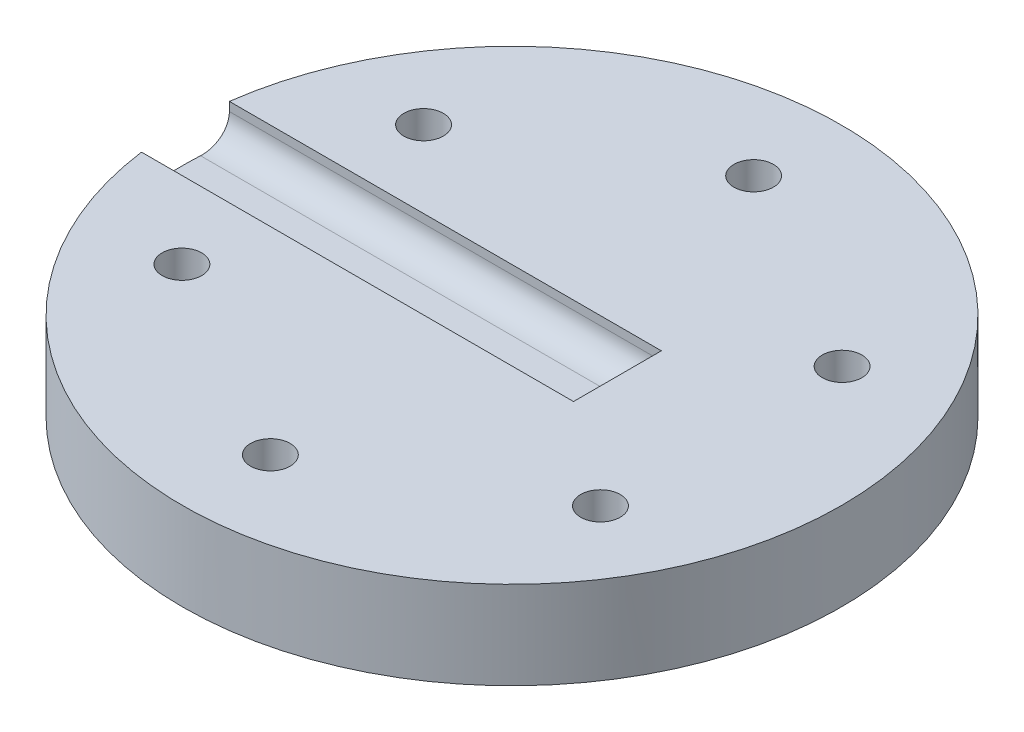
ISO-10303-21;
HEADER;
FILE_DESCRIPTION(('STEP AP214'),'2;1');
FILE_NAME('part.step','',(''),(''),'','','');
FILE_SCHEMA(('AUTOMOTIVE_DESIGN { 1 0 10303 214 1 1 1 1 }'));
ENDSEC;
DATA;
#1=APPLICATION_CONTEXT('core data for automotive mechanical design processes');
#2=APPLICATION_PROTOCOL_DEFINITION('international standard','automotive_design',2000,#1);
#3=PRODUCT_CONTEXT('',#1,'mechanical');
#4=PRODUCT('Part','Part','',(#3));
#5=PRODUCT_RELATED_PRODUCT_CATEGORY('part','',(#4));
#6=PRODUCT_DEFINITION_FORMATION('','',#4);
#7=PRODUCT_DEFINITION_CONTEXT('part definition',#1,'design');
#8=PRODUCT_DEFINITION('design','',#6,#7);
#9=PRODUCT_DEFINITION_SHAPE('','',#8);
#10=(LENGTH_UNIT() NAMED_UNIT(*) SI_UNIT(.MILLI.,.METRE.));
#11=(NAMED_UNIT(*) PLANE_ANGLE_UNIT() SI_UNIT($,.RADIAN.));
#12=(NAMED_UNIT(*) SI_UNIT($,.STERADIAN.) SOLID_ANGLE_UNIT());
#13=UNCERTAINTY_MEASURE_WITH_UNIT(LENGTH_MEASURE(1.E-05),#10,'distance_accuracy_value','');
#14=(GEOMETRIC_REPRESENTATION_CONTEXT(3) GLOBAL_UNCERTAINTY_ASSIGNED_CONTEXT((#13)) GLOBAL_UNIT_ASSIGNED_CONTEXT((#10,
#11,#12)) REPRESENTATION_CONTEXT('',''));
#15=CARTESIAN_POINT('',(0.,0.,0.));
#16=DIRECTION('',(0.,0.,1.));
#17=DIRECTION('',(1.,0.,0.));
#18=AXIS2_PLACEMENT_3D('',#15,#16,#17);
#19=CARTESIAN_POINT('',(0.,10.,0.));
#20=DIRECTION('',(0.,1.,0.));
#21=DIRECTION('',(0.,0.,1.));
#22=AXIS2_PLACEMENT_3D('',#19,#20,#21);
#23=PLANE('',#22);
#24=CARTESIAN_POINT('',(-23.8156986040715,10.,-13.749999999999));
#25=DIRECTION('',(0.,1.,0.));
#26=DIRECTION('',(0.,0.,1.));
#27=AXIS2_PLACEMENT_3D('',#24,#25,#26);
#28=CIRCLE('',#27,2.25);
#29=CARTESIAN_POINT('',(-23.8156986040715,10.,-11.499999999999));
#30=VERTEX_POINT('',#29);
#31=EDGE_CURVE('E120',#30,#30,#28,.T.);
#32=ORIENTED_EDGE('',*,*,#31,.F.);
#33=EDGE_LOOP('',(#32));
#34=FACE_BOUND('',#33,.T.);
#35=CARTESIAN_POINT('',(2.33805547061302E-12,10.,27.5));
#36=DIRECTION('',(0.,1.,0.));
#37=DIRECTION('',(0.,0.,1.));
#38=AXIS2_PLACEMENT_3D('',#35,#36,#37);
#39=CIRCLE('',#38,2.25);
#40=CARTESIAN_POINT('',(2.33805547061302E-12,10.,29.75));
#41=VERTEX_POINT('',#40);
#42=EDGE_CURVE('E132',#41,#41,#39,.T.);
#43=ORIENTED_EDGE('',*,*,#42,.F.);
#44=EDGE_LOOP('',(#43));
#45=FACE_BOUND('',#44,.T.);
#46=CARTESIAN_POINT('',(23.8156986040726,10.,-13.750000000001));
#47=DIRECTION('',(0.,1.,0.));
#48=DIRECTION('',(0.,0.,1.));
#49=AXIS2_PLACEMENT_3D('',#46,#47,#48);
#50=CIRCLE('',#49,2.25);
#51=CARTESIAN_POINT('',(23.8156986040726,10.,-11.500000000001));
#52=VERTEX_POINT('',#51);
#53=EDGE_CURVE('E144',#52,#52,#50,.T.);
#54=ORIENTED_EDGE('',*,*,#53,.F.);
#55=EDGE_LOOP('',(#54));
#56=FACE_BOUND('',#55,.T.);
#57=CARTESIAN_POINT('',(0.,10.,-27.5));
#58=DIRECTION('',(0.,1.,0.));
#59=DIRECTION('',(0.,0.,1.));
#60=AXIS2_PLACEMENT_3D('',#57,#58,#59);
#61=CIRCLE('',#60,2.25);
#62=CARTESIAN_POINT('',(0.,10.,-25.25));
#63=VERTEX_POINT('',#62);
#64=EDGE_CURVE('E150',#63,#63,#61,.T.);
#65=ORIENTED_EDGE('',*,*,#64,.F.);
#66=EDGE_LOOP('',(#65));
#67=FACE_BOUND('',#66,.T.);
#68=CARTESIAN_POINT('',(23.8156986040738,10.,13.749999999999));
#69=DIRECTION('',(0.,1.,0.));
#70=DIRECTION('',(0.,0.,1.));
#71=AXIS2_PLACEMENT_3D('',#68,#69,#70);
#72=CIRCLE('',#71,2.25);
#73=CARTESIAN_POINT('',(23.8156986040738,10.,15.999999999999));
#74=VERTEX_POINT('',#73);
#75=EDGE_CURVE('E138',#74,#74,#72,.T.);
#76=ORIENTED_EDGE('',*,*,#75,.F.);
#77=EDGE_LOOP('',(#76));
#78=FACE_BOUND('',#77,.T.);
#79=CARTESIAN_POINT('',(-23.8156986040703,10.,13.750000000001));
#80=DIRECTION('',(0.,1.,0.));
#81=DIRECTION('',(0.,0.,1.));
#82=AXIS2_PLACEMENT_3D('',#79,#80,#81);
#83=CIRCLE('',#82,2.25);
#84=CARTESIAN_POINT('',(-23.8156986040703,10.,16.000000000001));
#85=VERTEX_POINT('',#84);
#86=EDGE_CURVE('E126',#85,#85,#83,.T.);
#87=ORIENTED_EDGE('',*,*,#86,.F.);
#88=EDGE_LOOP('',(#87));
#89=FACE_BOUND('',#88,.T.);
#90=DIRECTION('',(0.,0.,1.));
#91=VECTOR('',#90,1.);
#92=CARTESIAN_POINT('',(12.,10.,0.));
#93=LINE('',#92,#91);
#94=CARTESIAN_POINT('',(12.,10.,-4.99999999999996));
#95=VERTEX_POINT('',#94);
#96=CARTESIAN_POINT('',(12.,10.,4.99999999999996));
#97=VERTEX_POINT('',#96);
#98=EDGE_CURVE('E101',#95,#97,#93,.T.);
#99=ORIENTED_EDGE('',*,*,#98,.T.);
#100=DIRECTION('',(-1.,0.,0.));
#101=VECTOR('',#100,1.);
#102=CARTESIAN_POINT('',(0.,10.,5.));
#103=LINE('',#102,#101);
#104=CARTESIAN_POINT('',(-37.1651718682963,10.,4.99999999999987));
#105=VERTEX_POINT('',#104);
#106=EDGE_CURVE('E110',#97,#105,#103,.T.);
#107=ORIENTED_EDGE('',*,*,#106,.T.);
#108=CARTESIAN_POINT('',(0.,10.,0.));
#109=DIRECTION('',(0.,1.,0.));
#110=DIRECTION('',(0.,0.,1.));
#111=AXIS2_PLACEMENT_3D('',#108,#109,#110);
#112=CIRCLE('',#111,37.5);
#113=CARTESIAN_POINT('',(-37.1651718682962,10.,-5.00000000000013));
#114=VERTEX_POINT('',#113);
#115=EDGE_CURVE('E109',#105,#114,#112,.T.);
#116=ORIENTED_EDGE('',*,*,#115,.T.);
#117=DIRECTION('',(-1.,0.,0.));
#118=VECTOR('',#117,1.);
#119=CARTESIAN_POINT('',(0.,10.,-5.));
#120=LINE('',#119,#118);
#121=EDGE_CURVE('E93',#95,#114,#120,.T.);
#122=ORIENTED_EDGE('',*,*,#121,.F.);
#123=EDGE_LOOP('',(#99,#107,#116,#122));
#124=FACE_BOUND('',#123,.T.);
#125=ADVANCED_FACE('F33',(#34,#45,#56,#67,#78,#89,#124),#23,.T.);
#126=CARTESIAN_POINT('',(0.,10.,0.));
#127=DIRECTION('',(0.,-1.,0.));
#128=DIRECTION('',(0.,0.,-1.));
#129=AXIS2_PLACEMENT_3D('',#126,#127,#128);
#130=CYLINDRICAL_SURFACE('',#129,37.5);
#131=CARTESIAN_POINT('',(0.,0.,0.));
#132=DIRECTION('',(0.,1.,0.));
#133=DIRECTION('',(0.,0.,1.));
#134=AXIS2_PLACEMENT_3D('',#131,#132,#133);
#135=CIRCLE('',#134,37.5);
#136=CARTESIAN_POINT('',(0.,0.,37.5));
#137=VERTEX_POINT('',#136);
#138=EDGE_CURVE('E153',#137,#137,#135,.T.);
#139=ORIENTED_EDGE('',*,*,#138,.T.);
#140=EDGE_LOOP('',(#139));
#141=FACE_BOUND('',#140,.T.);
#142=DIRECTION('',(0.,1.,0.));
#143=VECTOR('',#142,1.);
#144=CARTESIAN_POINT('',(-37.1651718682963,6.,4.99999999999987));
#145=LINE('',#144,#143);
#146=CARTESIAN_POINT('',(-37.1651718682963,9.,4.99999999999987));
#147=VERTEX_POINT('',#146);
#148=EDGE_CURVE('E117',#147,#105,#145,.T.);
#149=ORIENTED_EDGE('',*,*,#148,.F.);
#150=CARTESIAN_POINT('',(-37.1651718682963,9.,4.99999999999987));
#151=CARTESIAN_POINT('',(-37.1651685932494,8.91607473093556,5.00000850912993));
#152=CARTESIAN_POINT('',(-37.1656455989452,8.83215369455785,4.99647833367304));
#153=CARTESIAN_POINT('',(-37.1675358092273,8.66491826832527,4.98240646129069));
#154=CARTESIAN_POINT('',(-37.1689489434135,8.58160383332813,4.97186529161641));
#155=CARTESIAN_POINT('',(-37.1726850296843,8.41625662107855,4.94385244499646));
#156=CARTESIAN_POINT('',(-37.1750069942758,8.33422255290289,4.92638828998331));
#157=CARTESIAN_POINT('',(-37.1805105754043,8.17195103866243,4.88467724581381));
#158=CARTESIAN_POINT('',(-37.1836921862674,8.09171358074312,4.86043040142569));
#159=CARTESIAN_POINT('',(-37.1944408568588,7.8544882674871,4.77773055653877));
#160=CARTESIAN_POINT('',(-37.2032138737354,7.70089770069336,4.70930293695221));
#161=CARTESIAN_POINT('',(-37.2232832126167,7.40749281606239,4.54793917186818));
#162=CARTESIAN_POINT('',(-37.2345793683077,7.26767759109256,4.45500464168136));
#163=CARTESIAN_POINT('',(-37.2589116242929,7.00487012995653,4.24670781825409));
#164=CARTESIAN_POINT('',(-37.2719562576053,6.88196680121549,4.13123418046848));
#165=CARTESIAN_POINT('',(-37.2988015372646,6.6572171945591,3.88138598341652));
#166=CARTESIAN_POINT('',(-37.3126023471844,6.55537549553449,3.74700732476296));
#167=CARTESIAN_POINT('',(-37.3401120237986,6.3749911604644,3.46216999762798));
#168=CARTESIAN_POINT('',(-37.3538196771137,6.29660721864267,3.3116107736077));
#169=CARTESIAN_POINT('',(-37.3801828948026,6.16631519135388,2.99940021790014));
#170=CARTESIAN_POINT('',(-37.3928390809635,6.11439136402112,2.83775554635983));
#171=CARTESIAN_POINT('',(-37.4124983738007,6.05106027067528,2.56265705060473));
#172=CARTESIAN_POINT('',(-37.4199863799291,6.03193164985782,2.4509543538735));
#173=CARTESIAN_POINT('',(-37.4340334639008,6.0064015837983,2.22619359073371));
#174=CARTESIAN_POINT('',(-37.4405937269621,5.9999837612315,2.11313745748277));
#175=CARTESIAN_POINT('',(-37.4466286867056,6.,1.99999999999987));
#176=B_SPLINE_CURVE_WITH_KNOTS('',3,(#150,#151,#152,#153,#154,#155,#156,#157,#158,#159,#160,
#161,#162,#163,#164,#165,#166,#167,#168,#169,#170,#171,#172,#173,#174,#175),.UNSPECIFIED.,.F.,
.F.,(4,2,2,2,2,2,2,2,2,2,2,2,4),(0.,0.251692700658803,0.503366475289662,0.754767548613931,
1.00616696263818,1.50869595507598,2.01119183286945,2.51623594149171,3.02138973376223,
3.52988746532684,4.03808232308492,4.378130837416,4.71774092787654),.UNSPECIFIED.);
#177=CARTESIAN_POINT('',(-37.4466286867056,6.,1.99999999999987));
#178=VERTEX_POINT('',#177);
#179=EDGE_CURVE('E11',#147,#178,#176,.T.);
#180=ORIENTED_EDGE('',*,*,#179,.T.);
#181=CARTESIAN_POINT('',(0.,6.,0.));
#182=DIRECTION('',(0.,1.,0.));
#183=DIRECTION('',(0.,0.,1.));
#184=AXIS2_PLACEMENT_3D('',#181,#182,#183);
#185=CIRCLE('',#184,37.5);
#186=CARTESIAN_POINT('',(-37.4466286867056,6.,-2.00000000000013));
#187=VERTEX_POINT('',#186);
#188=EDGE_CURVE('E98',#187,#178,#185,.T.);
#189=ORIENTED_EDGE('',*,*,#188,.F.);
#190=CARTESIAN_POINT('',(-37.4466286867056,6.,-2.00000000000013));
#191=CARTESIAN_POINT('',(-37.442115393869,5.99999185556205,-2.08455601031386));
#192=CARTESIAN_POINT('',(-37.4373104530759,6.00357480316312,-2.16909175411238));
#193=CARTESIAN_POINT('',(-37.4271699634153,6.01785162064364,-2.33752249353557));
#194=CARTESIAN_POINT('',(-37.4218344541868,6.0285449596416,-2.42141753652377));
#195=CARTESIAN_POINT('',(-37.4106898894076,6.05695840872291,-2.58790382027702));
#196=CARTESIAN_POINT('',(-37.4048812683641,6.07467212781287,-2.67049617603146));
#197=CARTESIAN_POINT('',(-37.3928607707032,6.11697580130757,-2.83384627853584));
#198=CARTESIAN_POINT('',(-37.38664889606,6.14156572205405,-2.91460403426386));
#199=CARTESIAN_POINT('',(-37.3675242861865,6.22543430714798,-3.15333187203809));
#200=CARTESIAN_POINT('',(-37.3541164861043,6.29482717691523,-3.3078460844972));
#201=CARTESIAN_POINT('',(-37.3268156238785,6.45850047242245,-3.60289767557243));
#202=CARTESIAN_POINT('',(-37.3129226100249,6.5527784276038,-3.74343643974693));
#203=CARTESIAN_POINT('',(-37.285527433741,6.76392513867184,-4.00712813795826));
#204=CARTESIAN_POINT('',(-37.272026519585,6.8808585198335,-4.13022954973076));
#205=CARTESIAN_POINT('',(-37.2464263718208,7.13389913639611,-4.35506235412042));
#206=CARTESIAN_POINT('',(-37.2343273880348,7.27000977961427,-4.45678994056759));
#207=CARTESIAN_POINT('',(-37.2124653695551,7.55735594322181,-4.63579209345191));
#208=CARTESIAN_POINT('',(-37.2026991420278,7.7085703841388,-4.71310013012715));
#209=CARTESIAN_POINT('',(-37.1862553206564,8.02197020400218,-4.84113735417302));
#210=CARTESIAN_POINT('',(-37.1795756321588,8.18414805679171,-4.89188456993313));
#211=CARTESIAN_POINT('',(-37.171562377065,8.45615411997132,-4.95232456520221));
#212=CARTESIAN_POINT('',(-37.1691734992545,8.5642051706132,-4.97018998012791));
#213=CARTESIAN_POINT('',(-37.1659755418647,8.78148800360132,-4.99402686353313));
#214=CARTESIAN_POINT('',(-37.1651643604894,8.89071801987916,-5.00001415617528));
#215=CARTESIAN_POINT('',(-37.1651718682962,9.,-5.00000000000013));
#216=B_SPLINE_CURVE_WITH_KNOTS('',3,(#190,#191,#192,#193,#194,#195,#196,#197,#198,#199,#200,
#201,#202,#203,#204,#205,#206,#207,#208,#209,#210,#211,#212,#213,#214,#215),.UNSPECIFIED.,.F.,
.F.,(4,2,2,2,2,2,2,2,2,2,2,2,4),(0.,0.253944686852566,0.507870415620479,0.761565512474325,
1.01525936754025,1.52237729016386,2.02944488570951,2.53798078818341,3.04660717219958,
3.55453336036125,4.06211434061417,4.39012991539726,4.71770821006359),.UNSPECIFIED.);
#217=CARTESIAN_POINT('',(-37.1651718682962,9.,-5.00000000000013));
#218=VERTEX_POINT('',#217);
#219=EDGE_CURVE('E43',#187,#218,#216,.T.);
#220=ORIENTED_EDGE('',*,*,#219,.T.);
#221=DIRECTION('',(0.,1.,0.));
#222=VECTOR('',#221,1.);
#223=CARTESIAN_POINT('',(-37.1651718682962,6.,-5.00000000000013));
#224=LINE('',#223,#222);
#225=EDGE_CURVE('E97',#218,#114,#224,.T.);
#226=ORIENTED_EDGE('',*,*,#225,.T.);
#227=ORIENTED_EDGE('',*,*,#115,.F.);
#228=EDGE_LOOP('',(#149,#180,#189,#220,#226,#227));
#229=FACE_BOUND('',#228,.T.);
#230=ADVANCED_FACE('F177',(#141,#229),#130,.T.);
#231=CARTESIAN_POINT('',(0.,0.,0.));
#232=DIRECTION('',(0.,1.,0.));
#233=DIRECTION('',(0.,0.,1.));
#234=AXIS2_PLACEMENT_3D('',#231,#232,#233);
#235=PLANE('',#234);
#236=CARTESIAN_POINT('',(-23.8156986040703,0.,13.750000000001));
#237=DIRECTION('',(0.,1.,0.));
#238=DIRECTION('',(0.,0.,1.));
#239=AXIS2_PLACEMENT_3D('',#236,#237,#238);
#240=CIRCLE('',#239,2.25);
#241=CARTESIAN_POINT('',(-23.8156986040703,0.,16.000000000001));
#242=VERTEX_POINT('',#241);
#243=EDGE_CURVE('E123',#242,#242,#240,.T.);
#244=ORIENTED_EDGE('',*,*,#243,.T.);
#245=EDGE_LOOP('',(#244));
#246=FACE_BOUND('',#245,.T.);
#247=CARTESIAN_POINT('',(23.8156986040738,0.,13.749999999999));
#248=DIRECTION('',(0.,1.,0.));
#249=DIRECTION('',(0.,0.,1.));
#250=AXIS2_PLACEMENT_3D('',#247,#248,#249);
#251=CIRCLE('',#250,2.25);
#252=CARTESIAN_POINT('',(23.8156986040738,0.,15.999999999999));
#253=VERTEX_POINT('',#252);
#254=EDGE_CURVE('E135',#253,#253,#251,.T.);
#255=ORIENTED_EDGE('',*,*,#254,.T.);
#256=EDGE_LOOP('',(#255));
#257=FACE_BOUND('',#256,.T.);
#258=CARTESIAN_POINT('',(0.,0.,-27.5));
#259=DIRECTION('',(0.,1.,0.));
#260=DIRECTION('',(0.,0.,1.));
#261=AXIS2_PLACEMENT_3D('',#258,#259,#260);
#262=CIRCLE('',#261,2.25);
#263=CARTESIAN_POINT('',(0.,0.,-25.25));
#264=VERTEX_POINT('',#263);
#265=EDGE_CURVE('E147',#264,#264,#262,.T.);
#266=ORIENTED_EDGE('',*,*,#265,.T.);
#267=EDGE_LOOP('',(#266));
#268=FACE_BOUND('',#267,.T.);
#269=ORIENTED_EDGE('',*,*,#138,.F.);
#270=EDGE_LOOP('',(#269));
#271=FACE_BOUND('',#270,.T.);
#272=CARTESIAN_POINT('',(23.8156986040726,0.,-13.750000000001));
#273=DIRECTION('',(0.,1.,0.));
#274=DIRECTION('',(0.,0.,1.));
#275=AXIS2_PLACEMENT_3D('',#272,#273,#274);
#276=CIRCLE('',#275,2.25);
#277=CARTESIAN_POINT('',(23.8156986040726,0.,-11.500000000001));
#278=VERTEX_POINT('',#277);
#279=EDGE_CURVE('E141',#278,#278,#276,.T.);
#280=ORIENTED_EDGE('',*,*,#279,.T.);
#281=EDGE_LOOP('',(#280));
#282=FACE_BOUND('',#281,.T.);
#283=CARTESIAN_POINT('',(2.33805547061302E-12,0.,27.5));
#284=DIRECTION('',(0.,1.,0.));
#285=DIRECTION('',(0.,0.,1.));
#286=AXIS2_PLACEMENT_3D('',#283,#284,#285);
#287=CIRCLE('',#286,2.25);
#288=CARTESIAN_POINT('',(2.33805547061302E-12,0.,29.75));
#289=VERTEX_POINT('',#288);
#290=EDGE_CURVE('E129',#289,#289,#287,.T.);
#291=ORIENTED_EDGE('',*,*,#290,.T.);
#292=EDGE_LOOP('',(#291));
#293=FACE_BOUND('',#292,.T.);
#294=CARTESIAN_POINT('',(-23.8156986040715,0.,-13.749999999999));
#295=DIRECTION('',(0.,1.,0.));
#296=DIRECTION('',(0.,0.,1.));
#297=AXIS2_PLACEMENT_3D('',#294,#295,#296);
#298=CIRCLE('',#297,2.25);
#299=CARTESIAN_POINT('',(-23.8156986040715,0.,-11.499999999999));
#300=VERTEX_POINT('',#299);
#301=EDGE_CURVE('E116',#300,#300,#298,.T.);
#302=ORIENTED_EDGE('',*,*,#301,.T.);
#303=EDGE_LOOP('',(#302));
#304=FACE_BOUND('',#303,.T.);
#305=ADVANCED_FACE('F199',(#246,#257,#268,#271,#282,#293,#304),#235,.F.);
#306=CARTESIAN_POINT('',(0.,10.,-27.5));
#307=DIRECTION('',(0.,-1.,0.));
#308=DIRECTION('',(0.,0.,-1.));
#309=AXIS2_PLACEMENT_3D('',#306,#307,#308);
#310=CYLINDRICAL_SURFACE('',#309,2.25);
#311=ORIENTED_EDGE('',*,*,#64,.T.);
#312=EDGE_LOOP('',(#311));
#313=FACE_BOUND('',#312,.T.);
#314=ORIENTED_EDGE('',*,*,#265,.F.);
#315=EDGE_LOOP('',(#314));
#316=FACE_BOUND('',#315,.T.);
#317=ADVANCED_FACE('F204',(#313,#316),#310,.F.);
#318=CARTESIAN_POINT('',(23.8156986040726,10.,-13.750000000001));
#319=DIRECTION('',(0.,-1.,0.));
#320=DIRECTION('',(0.,0.,-1.));
#321=AXIS2_PLACEMENT_3D('',#318,#319,#320);
#322=CYLINDRICAL_SURFACE('',#321,2.25);
#323=ORIENTED_EDGE('',*,*,#53,.T.);
#324=EDGE_LOOP('',(#323));
#325=FACE_BOUND('',#324,.T.);
#326=ORIENTED_EDGE('',*,*,#279,.F.);
#327=EDGE_LOOP('',(#326));
#328=FACE_BOUND('',#327,.T.);
#329=ADVANCED_FACE('F211',(#325,#328),#322,.F.);
#330=CARTESIAN_POINT('',(23.8156986040738,10.,13.749999999999));
#331=DIRECTION('',(0.,-1.,0.));
#332=DIRECTION('',(0.,0.,-1.));
#333=AXIS2_PLACEMENT_3D('',#330,#331,#332);
#334=CYLINDRICAL_SURFACE('',#333,2.25);
#335=ORIENTED_EDGE('',*,*,#75,.T.);
#336=EDGE_LOOP('',(#335));
#337=FACE_BOUND('',#336,.T.);
#338=ORIENTED_EDGE('',*,*,#254,.F.);
#339=EDGE_LOOP('',(#338));
#340=FACE_BOUND('',#339,.T.);
#341=ADVANCED_FACE('F245',(#337,#340),#334,.F.);
#342=CARTESIAN_POINT('',(2.33805547061302E-12,10.,27.5));
#343=DIRECTION('',(0.,-1.,0.));
#344=DIRECTION('',(0.,0.,-1.));
#345=AXIS2_PLACEMENT_3D('',#342,#343,#344);
#346=CYLINDRICAL_SURFACE('',#345,2.25);
#347=ORIENTED_EDGE('',*,*,#42,.T.);
#348=EDGE_LOOP('',(#347));
#349=FACE_BOUND('',#348,.T.);
#350=ORIENTED_EDGE('',*,*,#290,.F.);
#351=EDGE_LOOP('',(#350));
#352=FACE_BOUND('',#351,.T.);
#353=ADVANCED_FACE('F238',(#349,#352),#346,.F.);
#354=CARTESIAN_POINT('',(-23.8156986040703,10.,13.750000000001));
#355=DIRECTION('',(0.,-1.,0.));
#356=DIRECTION('',(0.,0.,-1.));
#357=AXIS2_PLACEMENT_3D('',#354,#355,#356);
#358=CYLINDRICAL_SURFACE('',#357,2.25);
#359=ORIENTED_EDGE('',*,*,#86,.T.);
#360=EDGE_LOOP('',(#359));
#361=FACE_BOUND('',#360,.T.);
#362=ORIENTED_EDGE('',*,*,#243,.F.);
#363=EDGE_LOOP('',(#362));
#364=FACE_BOUND('',#363,.T.);
#365=ADVANCED_FACE('F229',(#361,#364),#358,.F.);
#366=CARTESIAN_POINT('',(-23.8156986040715,10.,-13.749999999999));
#367=DIRECTION('',(0.,-1.,0.));
#368=DIRECTION('',(0.,0.,-1.));
#369=AXIS2_PLACEMENT_3D('',#366,#367,#368);
#370=CYLINDRICAL_SURFACE('',#369,2.25);
#371=ORIENTED_EDGE('',*,*,#31,.T.);
#372=EDGE_LOOP('',(#371));
#373=FACE_BOUND('',#372,.T.);
#374=ORIENTED_EDGE('',*,*,#301,.F.);
#375=EDGE_LOOP('',(#374));
#376=FACE_BOUND('',#375,.T.);
#377=ADVANCED_FACE('F227',(#373,#376),#370,.F.);
#378=CARTESIAN_POINT('',(12.,6.,0.));
#379=DIRECTION('',(-1.,0.,0.));
#380=DIRECTION('',(0.,0.,1.));
#381=AXIS2_PLACEMENT_3D('',#378,#379,#380);
#382=PLANE('',#381);
#383=DIRECTION('',(0.,1.,0.));
#384=VECTOR('',#383,1.);
#385=CARTESIAN_POINT('',(12.,6.,-4.99999999999996));
#386=LINE('',#385,#384);
#387=CARTESIAN_POINT('',(12.,9.,-4.99999999999996));
#388=VERTEX_POINT('',#387);
#389=EDGE_CURVE('E88',#388,#95,#386,.T.);
#390=ORIENTED_EDGE('',*,*,#389,.F.);
#391=DIRECTION('',(0.,0.,1.));
#392=VECTOR('',#391,1.);
#393=CARTESIAN_POINT('',(12.,9.,4.99999999999996));
#394=LINE('',#393,#392);
#395=CARTESIAN_POINT('',(12.,9.,4.99999999999996));
#396=VERTEX_POINT('',#395);
#397=EDGE_CURVE('E59',#388,#396,#394,.T.);
#398=ORIENTED_EDGE('',*,*,#397,.T.);
#399=DIRECTION('',(0.,1.,0.));
#400=VECTOR('',#399,1.);
#401=CARTESIAN_POINT('',(12.,6.,4.99999999999996));
#402=LINE('',#401,#400);
#403=EDGE_CURVE('E103',#396,#97,#402,.T.);
#404=ORIENTED_EDGE('',*,*,#403,.T.);
#405=ORIENTED_EDGE('',*,*,#98,.F.);
#406=EDGE_LOOP('',(#390,#398,#404,#405));
#407=FACE_BOUND('',#406,.T.);
#408=ADVANCED_FACE('F102',(#407),#382,.T.);
#409=CARTESIAN_POINT('',(0.,6.,5.));
#410=DIRECTION('',(0.,0.,-1.));
#411=DIRECTION('',(-1.,0.,0.));
#412=AXIS2_PLACEMENT_3D('',#409,#410,#411);
#413=PLANE('',#412);
#414=ORIENTED_EDGE('',*,*,#403,.F.);
#415=DIRECTION('',(-1.,0.,0.));
#416=VECTOR('',#415,1.);
#417=CARTESIAN_POINT('',(-37.1651718682963,9.,4.99999999999987));
#418=LINE('',#417,#416);
#419=EDGE_CURVE('E51',#396,#147,#418,.T.);
#420=ORIENTED_EDGE('',*,*,#419,.T.);
#421=ORIENTED_EDGE('',*,*,#148,.T.);
#422=ORIENTED_EDGE('',*,*,#106,.F.);
#423=EDGE_LOOP('',(#414,#420,#421,#422));
#424=FACE_BOUND('',#423,.T.);
#425=ADVANCED_FACE('F236',(#424),#413,.T.);
#426=CARTESIAN_POINT('',(0.,6.,-5.));
#427=DIRECTION('',(0.,0.,-1.));
#428=DIRECTION('',(-1.,0.,0.));
#429=AXIS2_PLACEMENT_3D('',#426,#427,#428);
#430=PLANE('',#429);
#431=ORIENTED_EDGE('',*,*,#225,.F.);
#432=DIRECTION('',(-1.,0.,0.));
#433=VECTOR('',#432,1.);
#434=CARTESIAN_POINT('',(0.,9.,-5.));
#435=LINE('',#434,#433);
#436=EDGE_CURVE('E96',#218,#388,#435,.F.);
#437=ORIENTED_EDGE('',*,*,#436,.T.);
#438=ORIENTED_EDGE('',*,*,#389,.T.);
#439=ORIENTED_EDGE('',*,*,#121,.T.);
#440=EDGE_LOOP('',(#431,#437,#438,#439));
#441=FACE_BOUND('',#440,.T.);
#442=ADVANCED_FACE('F91',(#441),#430,.F.);
#443=CARTESIAN_POINT('',(0.,6.,0.));
#444=DIRECTION('',(0.,1.,0.));
#445=DIRECTION('',(0.,0.,1.));
#446=AXIS2_PLACEMENT_3D('',#443,#444,#445);
#447=PLANE('',#446);
#448=DIRECTION('',(0.,0.,1.));
#449=VECTOR('',#448,1.);
#450=CARTESIAN_POINT('',(9.00000000000002,6.,-4.99999999999997));
#451=LINE('',#450,#449);
#452=CARTESIAN_POINT('',(8.99999999999999,6.,2.00000000000003));
#453=VERTEX_POINT('',#452);
#454=CARTESIAN_POINT('',(9.00000000000001,6.,-1.99999999999997));
#455=VERTEX_POINT('',#454);
#456=EDGE_CURVE('E161',#453,#455,#451,.F.);
#457=ORIENTED_EDGE('',*,*,#456,.T.);
#458=DIRECTION('',(-1.,0.,0.));
#459=VECTOR('',#458,1.);
#460=CARTESIAN_POINT('',(0.,6.,-2.));
#461=LINE('',#460,#459);
#462=EDGE_CURVE('E163',#455,#187,#461,.T.);
#463=ORIENTED_EDGE('',*,*,#462,.T.);
#464=ORIENTED_EDGE('',*,*,#188,.T.);
#465=DIRECTION('',(-1.,0.,0.));
#466=VECTOR('',#465,1.);
#467=CARTESIAN_POINT('',(12.,6.,2.00000000000004));
#468=LINE('',#467,#466);
#469=EDGE_CURVE('E157',#178,#453,#468,.F.);
#470=ORIENTED_EDGE('',*,*,#469,.T.);
#471=EDGE_LOOP('',(#457,#463,#464,#470));
#472=FACE_BOUND('',#471,.T.);
#473=ADVANCED_FACE('F190',(#472),#447,.T.);
#474=CARTESIAN_POINT('',(0.,9.,2.));
#475=DIRECTION('',(1.,0.,0.));
#476=DIRECTION('',(0.,0.,-1.));
#477=AXIS2_PLACEMENT_3D('',#474,#475,#476);
#478=CYLINDRICAL_SURFACE('',#477,3.);
#479=ORIENTED_EDGE('',*,*,#179,.F.);
#480=ORIENTED_EDGE('',*,*,#419,.F.);
#481=CARTESIAN_POINT('',(8.99999999999999,9.,2.00000000000003));
#482=DIRECTION('',(0.70710678118655,0.,-0.707106781186545));
#483=DIRECTION('',(-0.707106781186545,0.,-0.70710678118655));
#484=AXIS2_PLACEMENT_3D('',#481,#482,#483);
#485=ELLIPSE('',#484,4.24264068711928,3.);
#486=EDGE_CURVE('E38',#453,#396,#485,.F.);
#487=ORIENTED_EDGE('',*,*,#486,.F.);
#488=ORIENTED_EDGE('',*,*,#469,.F.);
#489=EDGE_LOOP('',(#479,#480,#487,#488));
#490=FACE_BOUND('',#489,.T.);
#491=ADVANCED_FACE('F35',(#490),#478,.F.);
#492=CARTESIAN_POINT('',(9.,9.,0.));
#493=DIRECTION('',(0.,0.,-1.));
#494=DIRECTION('',(-1.,0.,0.));
#495=AXIS2_PLACEMENT_3D('',#492,#493,#494);
#496=CYLINDRICAL_SURFACE('',#495,3.);
#497=ORIENTED_EDGE('',*,*,#486,.T.);
#498=ORIENTED_EDGE('',*,*,#397,.F.);
#499=CARTESIAN_POINT('',(9.00000000000001,9.,-1.99999999999997));
#500=DIRECTION('',(-0.707106781186545,0.,-0.70710678118655));
#501=DIRECTION('',(-0.70710678118655,0.,0.707106781186545));
#502=AXIS2_PLACEMENT_3D('',#499,#500,#501);
#503=ELLIPSE('',#502,4.24264068711928,3.);
#504=EDGE_CURVE('E352',#455,#388,#503,.F.);
#505=ORIENTED_EDGE('',*,*,#504,.F.);
#506=ORIENTED_EDGE('',*,*,#456,.F.);
#507=EDGE_LOOP('',(#497,#498,#505,#506));
#508=FACE_BOUND('',#507,.T.);
#509=ADVANCED_FACE('F183',(#508),#496,.F.);
#510=CARTESIAN_POINT('',(0.,9.,-2.));
#511=DIRECTION('',(-1.,0.,0.));
#512=DIRECTION('',(0.,0.,1.));
#513=AXIS2_PLACEMENT_3D('',#510,#511,#512);
#514=CYLINDRICAL_SURFACE('',#513,3.);
#515=ORIENTED_EDGE('',*,*,#504,.T.);
#516=ORIENTED_EDGE('',*,*,#436,.F.);
#517=ORIENTED_EDGE('',*,*,#219,.F.);
#518=ORIENTED_EDGE('',*,*,#462,.F.);
#519=EDGE_LOOP('',(#515,#516,#517,#518));
#520=FACE_BOUND('',#519,.T.);
#521=ADVANCED_FACE('F180',(#520),#514,.F.);
#522=CLOSED_SHELL('',(#125,#230,#305,#317,#329,#341,#353,#365,#377,#408,#425,#442,#473,#491,
#509,#521));
#523=MANIFOLD_SOLID_BREP('B2',#522);
#524=ADVANCED_BREP_SHAPE_REPRESENTATION('',(#18,#523),#14);
#525=SHAPE_DEFINITION_REPRESENTATION(#9,#524);
ENDSEC;
END-ISO-10303-21;
